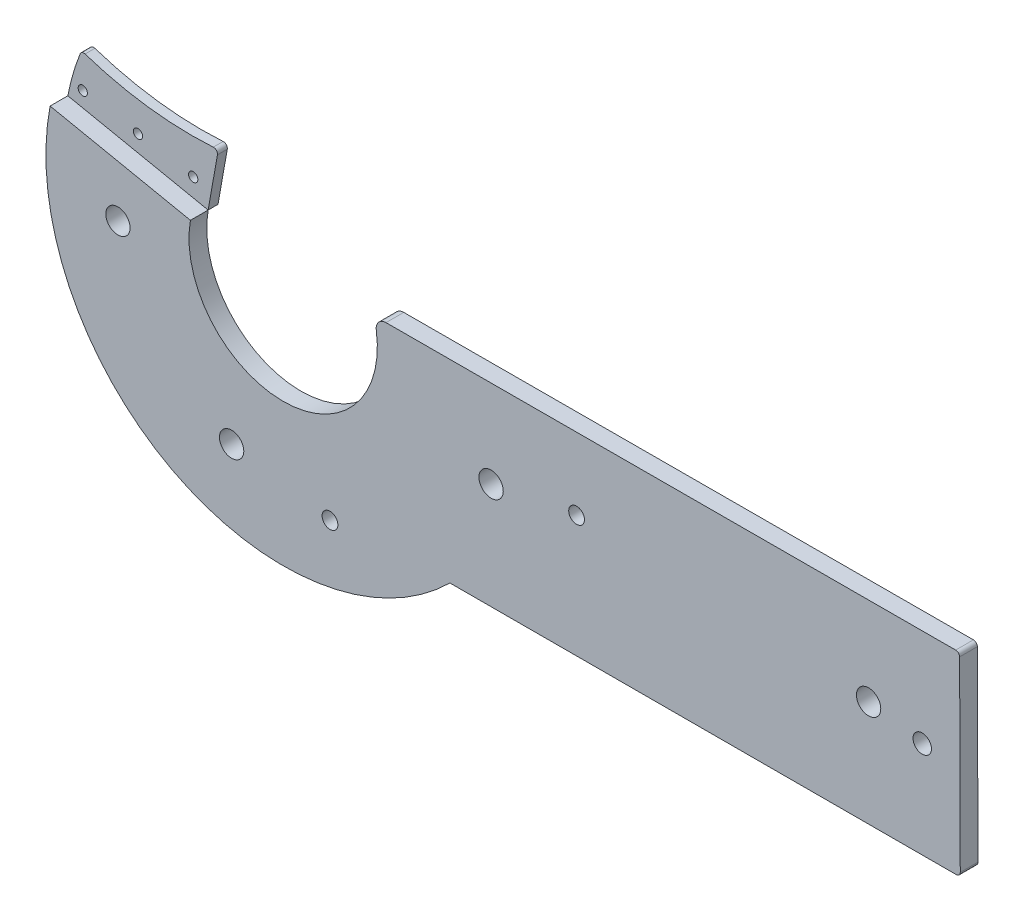
ISO-10303-21;
HEADER;
FILE_DESCRIPTION(('STEP AP214'),'2;1');
FILE_NAME('part.step','',(''),(''),'','','');
FILE_SCHEMA(('AUTOMOTIVE_DESIGN { 1 0 10303 214 1 1 1 1 }'));
ENDSEC;
DATA;
#1=APPLICATION_CONTEXT('core data for automotive mechanical design processes');
#2=APPLICATION_PROTOCOL_DEFINITION('international standard','automotive_design',2000,#1);
#3=PRODUCT_CONTEXT('',#1,'mechanical');
#4=PRODUCT('Part','Part','',(#3));
#5=PRODUCT_RELATED_PRODUCT_CATEGORY('part','',(#4));
#6=PRODUCT_DEFINITION_FORMATION('','',#4);
#7=PRODUCT_DEFINITION_CONTEXT('part definition',#1,'design');
#8=PRODUCT_DEFINITION('design','',#6,#7);
#9=PRODUCT_DEFINITION_SHAPE('','',#8);
#10=(LENGTH_UNIT() NAMED_UNIT(*) SI_UNIT(.MILLI.,.METRE.));
#11=(NAMED_UNIT(*) PLANE_ANGLE_UNIT() SI_UNIT($,.RADIAN.));
#12=(NAMED_UNIT(*) SI_UNIT($,.STERADIAN.) SOLID_ANGLE_UNIT());
#13=UNCERTAINTY_MEASURE_WITH_UNIT(LENGTH_MEASURE(1.E-05),#10,'distance_accuracy_value','');
#14=(GEOMETRIC_REPRESENTATION_CONTEXT(3) GLOBAL_UNCERTAINTY_ASSIGNED_CONTEXT((#13)) GLOBAL_UNIT_ASSIGNED_CONTEXT((#10,
#11,#12)) REPRESENTATION_CONTEXT('',''));
#15=CARTESIAN_POINT('',(0.,0.,0.));
#16=DIRECTION('',(0.,0.,1.));
#17=DIRECTION('',(1.,0.,0.));
#18=AXIS2_PLACEMENT_3D('',#15,#16,#17);
#19=CARTESIAN_POINT('',(85.1478365346288,124.368059743486,-5.));
#20=DIRECTION('',(0.,0.,-1.));
#21=DIRECTION('',(-1.,0.,0.));
#22=AXIS2_PLACEMENT_3D('',#19,#20,#21);
#23=PLANE('',#22);
#24=CARTESIAN_POINT('',(-25.5496424251232,153.010226503566,-5.));
#25=DIRECTION('',(0.,0.,-1.));
#26=DIRECTION('',(-1.,0.,0.));
#27=AXIS2_PLACEMENT_3D('',#24,#25,#26);
#28=CIRCLE('',#27,2.34999999999999);
#29=CARTESIAN_POINT('',(-27.8996424251232,153.010226503566,-5.));
#30=VERTEX_POINT('',#29);
#31=EDGE_CURVE('E167',#30,#30,#28,.T.);
#32=ORIENTED_EDGE('',*,*,#31,.F.);
#33=EDGE_LOOP('',(#32));
#34=FACE_BOUND('',#33,.T.);
#35=CARTESIAN_POINT('',(85.1478365346288,124.368059743486,-5.));
#36=DIRECTION('',(0.,0.,-1.));
#37=DIRECTION('',(-1.,0.,0.));
#38=AXIS2_PLACEMENT_3D('',#35,#36,#37);
#39=CIRCLE('',#38,120.419266545608);
#40=CARTESIAN_POINT('',(-33.1430876887958,146.908179569039,-5.));
#41=VERTEX_POINT('',#40);
#42=CARTESIAN_POINT('',(-26.8975363385449,168.488737130554,-5.));
#43=VERTEX_POINT('',#42);
#44=EDGE_CURVE('E137',#41,#43,#39,.T.);
#45=ORIENTED_EDGE('',*,*,#44,.T.);
#46=CARTESIAN_POINT('',(-25.0366153067641,167.755952773819,-5.));
#47=DIRECTION('',(0.,0.,-1.));
#48=DIRECTION('',(-1.,0.,0.));
#49=AXIS2_PLACEMENT_3D('',#46,#47,#48);
#50=CIRCLE('',#49,2.);
#51=CARTESIAN_POINT('',(-24.4074180608108,169.654402358529,-5.));
#52=VERTEX_POINT('',#51);
#53=EDGE_CURVE('E58',#43,#52,#50,.T.);
#54=ORIENTED_EDGE('',*,*,#53,.T.);
#55=CARTESIAN_POINT('',(29.8079807290533,333.236175768158,-5.));
#56=DIRECTION('',(0.,0.,1.));
#57=DIRECTION('',(-1.,0.,0.));
#58=AXIS2_PLACEMENT_3D('',#55,#56,#57);
#59=CIRCLE('',#58,172.331964701222);
#60=CARTESIAN_POINT('',(40.6968070367358,161.248561332047,-5.));
#61=VERTEX_POINT('',#60);
#62=EDGE_CURVE('E111',#52,#61,#59,.T.);
#63=ORIENTED_EDGE('',*,*,#62,.T.);
#64=CARTESIAN_POINT('',(40.8231773978764,159.252557691813,-5.));
#65=DIRECTION('',(0.,0.,-1.));
#66=DIRECTION('',(-1.,0.,0.));
#67=AXIS2_PLACEMENT_3D('',#64,#65,#66);
#68=CIRCLE('',#67,2.);
#69=CARTESIAN_POINT('',(42.792525815014,158.903749991328,-5.));
#70=VERTEX_POINT('',#69);
#71=EDGE_CURVE('E65',#61,#70,#68,.T.);
#72=ORIENTED_EDGE('',*,*,#71,.T.);
#73=DIRECTION('',(-0.17440385024251,-0.984674208568798,0.));
#74=VECTOR('',#73,1.);
#75=CARTESIAN_POINT('',(43.2396962330615,161.42844871142,-5.));
#76=LINE('',#75,#74);
#77=CARTESIAN_POINT('',(38.0785040558775,132.288651537943,-5.));
#78=VERTEX_POINT('',#77);
#79=EDGE_CURVE('E103',#70,#78,#76,.T.);
#80=ORIENTED_EDGE('',*,*,#79,.T.);
#81=DIRECTION('',(-0.979575697040969,0.201075741368022,0.));
#82=VECTOR('',#81,1.);
#83=CARTESIAN_POINT('',(-33.1430876887958,146.908179569039,-5.));
#84=LINE('',#83,#82);
#85=EDGE_CURVE('E107',#78,#41,#84,.T.);
#86=ORIENTED_EDGE('',*,*,#85,.T.);
#87=EDGE_LOOP('',(#45,#54,#63,#72,#80,#86));
#88=FACE_BOUND('',#87,.T.);
#89=CARTESIAN_POINT('',(2.46770818354081,148.035842501551,-5.));
#90=DIRECTION('',(0.,0.,-1.));
#91=DIRECTION('',(-1.,0.,0.));
#92=AXIS2_PLACEMENT_3D('',#89,#90,#91);
#93=CIRCLE('',#92,2.35);
#94=CARTESIAN_POINT('',(0.117708183540816,148.035842501551,-5.));
#95=VERTEX_POINT('',#94);
#96=EDGE_CURVE('E132',#95,#95,#93,.T.);
#97=ORIENTED_EDGE('',*,*,#96,.F.);
#98=EDGE_LOOP('',(#97));
#99=FACE_BOUND('',#98,.T.);
#100=CARTESIAN_POINT('',(30.4850587922048,143.061458499535,-5.));
#101=DIRECTION('',(0.,0.,-1.));
#102=DIRECTION('',(-1.,0.,0.));
#103=AXIS2_PLACEMENT_3D('',#100,#101,#102);
#104=CIRCLE('',#103,2.35);
#105=CARTESIAN_POINT('',(28.1350587922048,143.061458499535,-5.));
#106=VERTEX_POINT('',#105);
#107=EDGE_CURVE('E173',#106,#106,#104,.T.);
#108=ORIENTED_EDGE('',*,*,#107,.F.);
#109=EDGE_LOOP('',(#108));
#110=FACE_BOUND('',#109,.T.);
#111=ADVANCED_FACE('F50',(#34,#88,#99,#110),#23,.T.);
#112=CARTESIAN_POINT('',(85.1478365346288,124.368059743486,0.));
#113=DIRECTION('',(0.,0.,-1.));
#114=DIRECTION('',(-1.,0.,0.));
#115=AXIS2_PLACEMENT_3D('',#112,#113,#114);
#116=PLANE('',#115);
#117=CARTESIAN_POINT('',(29.8079807290533,333.236175768158,0.));
#118=DIRECTION('',(0.,0.,1.));
#119=DIRECTION('',(-1.,0.,0.));
#120=AXIS2_PLACEMENT_3D('',#117,#118,#119);
#121=CIRCLE('',#120,172.331964701222);
#122=CARTESIAN_POINT('',(-24.4074180608108,169.654402358529,0.));
#123=VERTEX_POINT('',#122);
#124=CARTESIAN_POINT('',(40.6968070367358,161.248561332047,0.));
#125=VERTEX_POINT('',#124);
#126=EDGE_CURVE('E131',#123,#125,#121,.T.);
#127=ORIENTED_EDGE('',*,*,#126,.F.);
#128=CARTESIAN_POINT('',(-25.0366153067641,167.755952773819,0.));
#129=DIRECTION('',(0.,0.,-1.));
#130=DIRECTION('',(-1.,0.,0.));
#131=AXIS2_PLACEMENT_3D('',#128,#129,#130);
#132=CIRCLE('',#131,2.);
#133=CARTESIAN_POINT('',(-26.8975363385449,168.488737130554,0.));
#134=VERTEX_POINT('',#133);
#135=EDGE_CURVE('E145',#123,#134,#132,.F.);
#136=ORIENTED_EDGE('',*,*,#135,.T.);
#137=CARTESIAN_POINT('',(85.1478365346288,124.368059743486,0.));
#138=DIRECTION('',(0.,0.,-1.));
#139=DIRECTION('',(-1.,0.,0.));
#140=AXIS2_PLACEMENT_3D('',#137,#138,#139);
#141=CIRCLE('',#140,120.419266545608);
#142=CARTESIAN_POINT('',(-33.1430876887958,146.908179569039,0.));
#143=VERTEX_POINT('',#142);
#144=EDGE_CURVE('E129',#143,#134,#141,.T.);
#145=ORIENTED_EDGE('',*,*,#144,.F.);
#146=DIRECTION('',(-0.979575697040969,0.201075741368022,0.));
#147=VECTOR('',#146,1.);
#148=CARTESIAN_POINT('',(-33.1430876887958,146.908179569039,0.));
#149=LINE('',#148,#147);
#150=CARTESIAN_POINT('',(38.0785040558775,132.288651537943,0.));
#151=VERTEX_POINT('',#150);
#152=EDGE_CURVE('E136',#151,#143,#149,.T.);
#153=ORIENTED_EDGE('',*,*,#152,.F.);
#154=DIRECTION('',(-0.17440385024251,-0.984674208568798,0.));
#155=VECTOR('',#154,1.);
#156=CARTESIAN_POINT('',(43.2396962330615,161.42844871142,0.));
#157=LINE('',#156,#155);
#158=CARTESIAN_POINT('',(42.792525815014,158.903749991328,0.));
#159=VERTEX_POINT('',#158);
#160=EDGE_CURVE('E117',#159,#151,#157,.T.);
#161=ORIENTED_EDGE('',*,*,#160,.F.);
#162=CARTESIAN_POINT('',(40.8231773978764,159.252557691813,0.));
#163=DIRECTION('',(0.,0.,-1.));
#164=DIRECTION('',(-1.,0.,0.));
#165=AXIS2_PLACEMENT_3D('',#162,#163,#164);
#166=CIRCLE('',#165,2.);
#167=EDGE_CURVE('E143',#159,#125,#166,.F.);
#168=ORIENTED_EDGE('',*,*,#167,.T.);
#169=EDGE_LOOP('',(#127,#136,#145,#153,#161,#168));
#170=FACE_BOUND('',#169,.T.);
#171=CARTESIAN_POINT('',(2.46770818354081,148.035842501551,0.));
#172=DIRECTION('',(0.,0.,-1.));
#173=DIRECTION('',(-1.,0.,0.));
#174=AXIS2_PLACEMENT_3D('',#171,#172,#173);
#175=CIRCLE('',#174,2.35);
#176=CARTESIAN_POINT('',(0.117708183540816,148.035842501551,0.));
#177=VERTEX_POINT('',#176);
#178=EDGE_CURVE('E164',#177,#177,#175,.T.);
#179=ORIENTED_EDGE('',*,*,#178,.T.);
#180=EDGE_LOOP('',(#179));
#181=FACE_BOUND('',#180,.T.);
#182=CARTESIAN_POINT('',(-25.5496424251232,153.010226503566,0.));
#183=DIRECTION('',(0.,0.,-1.));
#184=DIRECTION('',(-1.,0.,0.));
#185=AXIS2_PLACEMENT_3D('',#182,#183,#184);
#186=CIRCLE('',#185,2.34999999999999);
#187=CARTESIAN_POINT('',(-27.8996424251232,153.010226503566,0.));
#188=VERTEX_POINT('',#187);
#189=EDGE_CURVE('E170',#188,#188,#186,.T.);
#190=ORIENTED_EDGE('',*,*,#189,.T.);
#191=EDGE_LOOP('',(#190));
#192=FACE_BOUND('',#191,.T.);
#193=CARTESIAN_POINT('',(30.4850587922048,143.061458499535,0.));
#194=DIRECTION('',(0.,0.,-1.));
#195=DIRECTION('',(-1.,0.,0.));
#196=AXIS2_PLACEMENT_3D('',#193,#194,#195);
#197=CIRCLE('',#196,2.35);
#198=CARTESIAN_POINT('',(28.1350587922048,143.061458499535,0.));
#199=VERTEX_POINT('',#198);
#200=EDGE_CURVE('E176',#199,#199,#197,.T.);
#201=ORIENTED_EDGE('',*,*,#200,.T.);
#202=EDGE_LOOP('',(#201));
#203=FACE_BOUND('',#202,.T.);
#204=ADVANCED_FACE('F159',(#170,#181,#192,#203),#116,.F.);
#205=CARTESIAN_POINT('',(85.1478365346288,124.368059743486,-5.));
#206=DIRECTION('',(0.,0.,1.));
#207=DIRECTION('',(1.,0.,0.));
#208=AXIS2_PLACEMENT_3D('',#205,#206,#207);
#209=CYLINDRICAL_SURFACE('',#208,120.419266545608);
#210=ORIENTED_EDGE('',*,*,#144,.T.);
#211=DIRECTION('',(0.,0.,1.));
#212=VECTOR('',#211,1.);
#213=CARTESIAN_POINT('',(-26.8975363385449,168.488737130554,-5.));
#214=LINE('',#213,#212);
#215=EDGE_CURVE('E73',#134,#43,#214,.F.);
#216=ORIENTED_EDGE('',*,*,#215,.T.);
#217=ORIENTED_EDGE('',*,*,#44,.F.);
#218=DIRECTION('',(0.,0.,1.));
#219=VECTOR('',#218,1.);
#220=CARTESIAN_POINT('',(-33.1430876887958,146.908179569039,-5.));
#221=LINE('',#220,#219);
#222=EDGE_CURVE('E121',#41,#143,#221,.T.);
#223=ORIENTED_EDGE('',*,*,#222,.T.);
#224=EDGE_LOOP('',(#210,#216,#217,#223));
#225=FACE_BOUND('',#224,.T.);
#226=ADVANCED_FACE('F161',(#225),#209,.T.);
#227=CARTESIAN_POINT('',(29.8079807290533,333.236175768158,-5.));
#228=DIRECTION('',(0.,0.,1.));
#229=DIRECTION('',(1.,0.,0.));
#230=AXIS2_PLACEMENT_3D('',#227,#228,#229);
#231=CYLINDRICAL_SURFACE('',#230,172.331964701222);
#232=ORIENTED_EDGE('',*,*,#62,.F.);
#233=DIRECTION('',(0.,0.,1.));
#234=VECTOR('',#233,1.);
#235=CARTESIAN_POINT('',(-24.4074180608108,169.654402358529,-5.));
#236=LINE('',#235,#234);
#237=EDGE_CURVE('E140',#52,#123,#236,.T.);
#238=ORIENTED_EDGE('',*,*,#237,.T.);
#239=ORIENTED_EDGE('',*,*,#126,.T.);
#240=DIRECTION('',(0.,0.,1.));
#241=VECTOR('',#240,1.);
#242=CARTESIAN_POINT('',(40.6968070367358,161.248561332047,-5.));
#243=LINE('',#242,#241);
#244=EDGE_CURVE('E120',#125,#61,#243,.F.);
#245=ORIENTED_EDGE('',*,*,#244,.T.);
#246=EDGE_LOOP('',(#232,#238,#239,#245));
#247=FACE_BOUND('',#246,.T.);
#248=ADVANCED_FACE('F153',(#247),#231,.F.);
#249=CARTESIAN_POINT('',(43.2396962330615,161.42844871142,-5.));
#250=DIRECTION('',(-0.984674208568798,0.17440385024251,0.));
#251=DIRECTION('',(-0.17440385024251,-0.984674208568798,0.));
#252=AXIS2_PLACEMENT_3D('',#249,#250,#251);
#253=PLANE('',#252);
#254=ORIENTED_EDGE('',*,*,#79,.F.);
#255=DIRECTION('',(0.,0.,1.));
#256=VECTOR('',#255,1.);
#257=CARTESIAN_POINT('',(42.792525815014,158.903749991328,-5.));
#258=LINE('',#257,#256);
#259=EDGE_CURVE('E12',#70,#159,#258,.T.);
#260=ORIENTED_EDGE('',*,*,#259,.T.);
#261=ORIENTED_EDGE('',*,*,#160,.T.);
#262=DIRECTION('',(0.,0.,1.));
#263=VECTOR('',#262,1.);
#264=CARTESIAN_POINT('',(38.0785040558775,132.288651537943,-5.));
#265=LINE('',#264,#263);
#266=EDGE_CURVE('E114',#78,#151,#265,.T.);
#267=ORIENTED_EDGE('',*,*,#266,.F.);
#268=EDGE_LOOP('',(#254,#260,#261,#267));
#269=FACE_BOUND('',#268,.T.);
#270=ADVANCED_FACE('F115',(#269),#253,.F.);
#271=CARTESIAN_POINT('',(-33.1430876887958,146.908179569039,-5.));
#272=DIRECTION('',(0.201075741368022,0.979575697040969,0.));
#273=DIRECTION('',(-0.979575697040969,0.201075741368022,0.));
#274=AXIS2_PLACEMENT_3D('',#271,#272,#273);
#275=PLANE('',#274);
#276=ORIENTED_EDGE('',*,*,#152,.T.);
#277=ORIENTED_EDGE('',*,*,#222,.F.);
#278=ORIENTED_EDGE('',*,*,#85,.F.);
#279=ORIENTED_EDGE('',*,*,#266,.T.);
#280=EDGE_LOOP('',(#276,#277,#278,#279));
#281=FACE_BOUND('',#280,.T.);
#282=ADVANCED_FACE('F123',(#281),#275,.F.);
#283=CARTESIAN_POINT('',(2.46770818354081,148.035842501551,-5.));
#284=DIRECTION('',(0.,0.,1.));
#285=DIRECTION('',(1.,0.,0.));
#286=AXIS2_PLACEMENT_3D('',#283,#284,#285);
#287=CYLINDRICAL_SURFACE('',#286,2.35);
#288=ORIENTED_EDGE('',*,*,#96,.T.);
#289=EDGE_LOOP('',(#288));
#290=FACE_BOUND('',#289,.T.);
#291=ORIENTED_EDGE('',*,*,#178,.F.);
#292=EDGE_LOOP('',(#291));
#293=FACE_BOUND('',#292,.T.);
#294=ADVANCED_FACE('F194',(#290,#293),#287,.F.);
#295=CARTESIAN_POINT('',(-25.5496424251232,153.010226503566,-5.));
#296=DIRECTION('',(0.,0.,1.));
#297=DIRECTION('',(1.,0.,0.));
#298=AXIS2_PLACEMENT_3D('',#295,#296,#297);
#299=CYLINDRICAL_SURFACE('',#298,2.34999999999999);
#300=ORIENTED_EDGE('',*,*,#31,.T.);
#301=EDGE_LOOP('',(#300));
#302=FACE_BOUND('',#301,.T.);
#303=ORIENTED_EDGE('',*,*,#189,.F.);
#304=EDGE_LOOP('',(#303));
#305=FACE_BOUND('',#304,.T.);
#306=ADVANCED_FACE('F210',(#302,#305),#299,.F.);
#307=CARTESIAN_POINT('',(30.4850587922048,143.061458499535,-5.));
#308=DIRECTION('',(0.,0.,1.));
#309=DIRECTION('',(1.,0.,0.));
#310=AXIS2_PLACEMENT_3D('',#307,#308,#309);
#311=CYLINDRICAL_SURFACE('',#310,2.35);
#312=ORIENTED_EDGE('',*,*,#107,.T.);
#313=EDGE_LOOP('',(#312));
#314=FACE_BOUND('',#313,.T.);
#315=ORIENTED_EDGE('',*,*,#200,.F.);
#316=EDGE_LOOP('',(#315));
#317=FACE_BOUND('',#316,.T.);
#318=ADVANCED_FACE('F182',(#314,#317),#311,.F.);
#319=CARTESIAN_POINT('',(-25.0366153067641,167.755952773819,-5.));
#320=DIRECTION('',(0.,0.,-1.));
#321=DIRECTION('',(-1.,0.,0.));
#322=AXIS2_PLACEMENT_3D('',#319,#320,#321);
#323=CYLINDRICAL_SURFACE('',#322,2.);
#324=ORIENTED_EDGE('',*,*,#53,.F.);
#325=ORIENTED_EDGE('',*,*,#215,.F.);
#326=ORIENTED_EDGE('',*,*,#135,.F.);
#327=ORIENTED_EDGE('',*,*,#237,.F.);
#328=EDGE_LOOP('',(#324,#325,#326,#327));
#329=FACE_BOUND('',#328,.T.);
#330=ADVANCED_FACE('F156',(#329),#323,.T.);
#331=CARTESIAN_POINT('',(40.8231773978764,159.252557691813,-5.));
#332=DIRECTION('',(0.,0.,1.));
#333=DIRECTION('',(1.,0.,0.));
#334=AXIS2_PLACEMENT_3D('',#331,#332,#333);
#335=CYLINDRICAL_SURFACE('',#334,2.);
#336=ORIENTED_EDGE('',*,*,#71,.F.);
#337=ORIENTED_EDGE('',*,*,#244,.F.);
#338=ORIENTED_EDGE('',*,*,#167,.F.);
#339=ORIENTED_EDGE('',*,*,#259,.F.);
#340=EDGE_LOOP('',(#336,#337,#338,#339));
#341=FACE_BOUND('',#340,.T.);
#342=ADVANCED_FACE('F52',(#341),#335,.T.);
#343=CLOSED_SHELL('',(#111,#204,#226,#248,#270,#282,#294,#306,#318,#330,#342));
#344=MANIFOLD_SOLID_BREP('B2',#343);
#345=CARTESIAN_POINT('',(85.1478365346288,124.368059743486,9.));
#346=DIRECTION('',(0.,0.,1.));
#347=DIRECTION('',(1.,0.,0.));
#348=AXIS2_PLACEMENT_3D('',#345,#346,#347);
#349=PLANE('',#348);
#350=CARTESIAN_POINT('',(108.920722633758,35.8266026056695,9.));
#351=DIRECTION('',(0.,0.,1.));
#352=DIRECTION('',(1.,0.,0.));
#353=AXIS2_PLACEMENT_3D('',#350,#351,#352);
#354=CIRCLE('',#353,4.00000000000001);
#355=CARTESIAN_POINT('',(112.920722633758,35.8266026056695,9.));
#356=VERTEX_POINT('',#355);
#357=EDGE_CURVE('E498',#356,#356,#354,.T.);
#358=ORIENTED_EDGE('',*,*,#357,.F.);
#359=EDGE_LOOP('',(#358));
#360=FACE_BOUND('',#359,.T.);
#361=CARTESIAN_POINT('',(234.08314410496,100.646929332703,9.));
#362=DIRECTION('',(0.,0.,1.));
#363=DIRECTION('',(1.,0.,0.));
#364=AXIS2_PLACEMENT_3D('',#361,#362,#363);
#365=CIRCLE('',#364,3.99999999999999);
#366=CARTESIAN_POINT('',(238.08314410496,100.646929332703,9.));
#367=VERTEX_POINT('',#366);
#368=EDGE_CURVE('E486',#367,#367,#365,.T.);
#369=ORIENTED_EDGE('',*,*,#368,.F.);
#370=EDGE_LOOP('',(#369));
#371=FACE_BOUND('',#370,.T.);
#372=CARTESIAN_POINT('',(382.297443758969,92.7239824857239,9.));
#373=DIRECTION('',(0.,0.,1.));
#374=DIRECTION('',(1.,0.,0.));
#375=AXIS2_PLACEMENT_3D('',#372,#373,#374);
#376=CIRCLE('',#375,6.17499999999997);
#377=CARTESIAN_POINT('',(388.472443758969,92.7239824857239,9.));
#378=VERTEX_POINT('',#377);
#379=EDGE_CURVE('E473',#378,#378,#376,.T.);
#380=ORIENTED_EDGE('',*,*,#379,.F.);
#381=EDGE_LOOP('',(#380));
#382=FACE_BOUND('',#381,.T.);
#383=DIRECTION('',(-0.00344386395279394,0.999994069882954,0.));
#384=VECTOR('',#383,1.);
#385=CARTESIAN_POINT('',(428.491868013747,137.593385628409,9.));
#386=LINE('',#385,#384);
#387=CARTESIAN_POINT('',(428.82437637219,41.0430017610581,9.));
#388=VERTEX_POINT('',#387);
#389=CARTESIAN_POINT('',(428.498747132906,135.59589720849,9.));
#390=VERTEX_POINT('',#389);
#391=EDGE_CURVE('E390',#388,#390,#386,.T.);
#392=ORIENTED_EDGE('',*,*,#391,.T.);
#393=CARTESIAN_POINT('',(426.49875899314,135.589009480584,9.));
#394=DIRECTION('',(0.,0.,1.));
#395=DIRECTION('',(1.,0.,0.));
#396=AXIS2_PLACEMENT_3D('',#393,#394,#395);
#397=CIRCLE('',#396,2.);
#398=CARTESIAN_POINT('',(426.494372552627,137.589004670363,9.));
#399=VERTEX_POINT('',#398);
#400=EDGE_CURVE('E320',#390,#399,#397,.T.);
#401=ORIENTED_EDGE('',*,*,#400,.T.);
#402=DIRECTION('',(-0.99999759488956,-0.00219322025694324,0.));
#403=VECTOR('',#402,1.);
#404=CARTESIAN_POINT('',(131.185001267815,136.941324617454,9.));
#405=LINE('',#404,#403);
#406=CARTESIAN_POINT('',(137.352673442184,136.954851713539,9.));
#407=VERTEX_POINT('',#406);
#408=EDGE_CURVE('E437',#399,#407,#405,.T.);
#409=ORIENTED_EDGE('',*,*,#408,.T.);
#410=CARTESIAN_POINT('',(137.363639543468,131.954863739092,9.));
#411=DIRECTION('',(0.,0.,1.));
#412=DIRECTION('',(1.,0.,0.));
#413=AXIS2_PLACEMENT_3D('',#410,#411,#412);
#414=CIRCLE('',#413,5.);
#415=CARTESIAN_POINT('',(132.420278792512,131.204407553892,9.));
#416=VERTEX_POINT('',#415);
#417=EDGE_CURVE('E421',#407,#416,#414,.T.);
#418=ORIENTED_EDGE('',*,*,#417,.T.);
#419=CARTESIAN_POINT('',(85.1607061918032,124.029887959864,9.));
#420=DIRECTION('',(0.,0.,-1.));
#421=DIRECTION('',(1.,0.,0.));
#422=AXIS2_PLACEMENT_3D('',#419,#420,#421);
#423=CIRCLE('',#422,47.8010557812982);
#424=CARTESIAN_POINT('',(38.0785040558775,132.288651537943,9.));
#425=VERTEX_POINT('',#424);
#426=EDGE_CURVE('E445',#416,#425,#423,.T.);
#427=ORIENTED_EDGE('',*,*,#426,.T.);
#428=DIRECTION('',(-0.979575697040969,0.201075741368022,0.));
#429=VECTOR('',#428,1.);
#430=CARTESIAN_POINT('',(38.0785040558774,132.288651537943,9.));
#431=LINE('',#430,#429);
#432=CARTESIAN_POINT('',(-33.1430876887958,146.908179569039,9.));
#433=VERTEX_POINT('',#432);
#434=EDGE_CURVE('E396',#425,#433,#431,.T.);
#435=ORIENTED_EDGE('',*,*,#434,.T.);
#436=CARTESIAN_POINT('',(85.1478365346288,124.368059743486,9.));
#437=DIRECTION('',(0.,0.,1.));
#438=DIRECTION('',(1.,0.,0.));
#439=AXIS2_PLACEMENT_3D('',#436,#437,#438);
#440=CIRCLE('',#439,120.419266545608);
#441=CARTESIAN_POINT('',(169.784133841993,38.7088691479545,9.));
#442=VERTEX_POINT('',#441);
#443=EDGE_CURVE('E391',#433,#442,#440,.T.);
#444=ORIENTED_EDGE('',*,*,#443,.T.);
#445=DIRECTION('',(0.999999189582848,0.0012731196517639,0.));
#446=VECTOR('',#445,1.);
#447=CARTESIAN_POINT('',(169.784133841993,38.7088691479545,9.));
#448=LINE('',#447,#446);
#449=CARTESIAN_POINT('',(426.826934471727,39.0361156539868,9.));
#450=VERTEX_POINT('',#449);
#451=EDGE_CURVE('E382',#442,#450,#448,.T.);
#452=ORIENTED_EDGE('',*,*,#451,.T.);
#453=CARTESIAN_POINT('',(426.824388232424,41.0361140331525,9.));
#454=DIRECTION('',(0.,0.,1.));
#455=DIRECTION('',(1.,0.,0.));
#456=AXIS2_PLACEMENT_3D('',#453,#454,#455);
#457=CIRCLE('',#456,2.);
#458=EDGE_CURVE('E434',#450,#388,#457,.T.);
#459=ORIENTED_EDGE('',*,*,#458,.T.);
#460=EDGE_LOOP('',(#392,#401,#409,#418,#427,#435,#444,#452,#459));
#461=FACE_BOUND('',#460,.T.);
#462=CARTESIAN_POINT('',(190.69502548042,92.6156914569061,9.));
#463=DIRECTION('',(0.,0.,1.));
#464=DIRECTION('',(1.,0.,0.));
#465=AXIS2_PLACEMENT_3D('',#462,#463,#464);
#466=CIRCLE('',#465,6.17499999999999);
#467=CARTESIAN_POINT('',(196.87002548042,92.6156914569061,9.));
#468=VERTEX_POINT('',#467);
#469=EDGE_CURVE('E466',#468,#468,#466,.T.);
#470=ORIENTED_EDGE('',*,*,#469,.F.);
#471=EDGE_LOOP('',(#470));
#472=FACE_BOUND('',#471,.T.);
#473=CARTESIAN_POINT('',(409.521133250289,88.0049079975689,9.));
#474=DIRECTION('',(0.,0.,1.));
#475=DIRECTION('',(1.,0.,0.));
#476=AXIS2_PLACEMENT_3D('',#473,#474,#475);
#477=CIRCLE('',#476,4.67499999999999);
#478=CARTESIAN_POINT('',(414.196133250289,88.0049079975689,9.));
#479=VERTEX_POINT('',#478);
#480=EDGE_CURVE('E480',#479,#479,#477,.T.);
#481=ORIENTED_EDGE('',*,*,#480,.F.);
#482=EDGE_LOOP('',(#481));
#483=FACE_BOUND('',#482,.T.);
#484=CARTESIAN_POINT('',(58.9921068538031,44.3279909760892,9.));
#485=DIRECTION('',(0.,0.,1.));
#486=DIRECTION('',(1.,0.,0.));
#487=AXIS2_PLACEMENT_3D('',#484,#485,#486);
#488=CIRCLE('',#487,6.17500000000001);
#489=CARTESIAN_POINT('',(65.1671068538031,44.3279909760892,9.));
#490=VERTEX_POINT('',#489);
#491=EDGE_CURVE('E492',#490,#490,#488,.T.);
#492=ORIENTED_EDGE('',*,*,#491,.F.);
#493=EDGE_LOOP('',(#492));
#494=FACE_BOUND('',#493,.T.);
#495=CARTESIAN_POINT('',(1.28804924227482,113.626800727221,9.));
#496=DIRECTION('',(0.,0.,1.));
#497=DIRECTION('',(1.,0.,0.));
#498=AXIS2_PLACEMENT_3D('',#495,#496,#497);
#499=CIRCLE('',#498,6.175);
#500=CARTESIAN_POINT('',(7.46304924227482,113.626800727221,9.));
#501=VERTEX_POINT('',#500);
#502=EDGE_CURVE('E504',#501,#501,#499,.T.);
#503=ORIENTED_EDGE('',*,*,#502,.F.);
#504=EDGE_LOOP('',(#503));
#505=FACE_BOUND('',#504,.T.);
#506=ADVANCED_FACE('F312',(#360,#371,#382,#461,#472,#483,#494,#505),#349,.T.);
#507=CARTESIAN_POINT('',(85.1478365346288,124.368059743486,0.));
#508=DIRECTION('',(0.,0.,1.));
#509=DIRECTION('',(1.,0.,0.));
#510=AXIS2_PLACEMENT_3D('',#507,#508,#509);
#511=PLANE('',#510);
#512=DIRECTION('',(-0.99999759488956,-0.00219322025694324,0.));
#513=VECTOR('',#512,1.);
#514=CARTESIAN_POINT('',(131.185001267815,136.941324617454,0.));
#515=LINE('',#514,#513);
#516=CARTESIAN_POINT('',(426.494372552627,137.589004670363,0.));
#517=VERTEX_POINT('',#516);
#518=CARTESIAN_POINT('',(137.352673442184,136.954851713539,0.));
#519=VERTEX_POINT('',#518);
#520=EDGE_CURVE('E453',#517,#519,#515,.T.);
#521=ORIENTED_EDGE('',*,*,#520,.F.);
#522=CARTESIAN_POINT('',(426.49875899314,135.589009480584,0.));
#523=DIRECTION('',(0.,0.,1.));
#524=DIRECTION('',(1.,0.,0.));
#525=AXIS2_PLACEMENT_3D('',#522,#523,#524);
#526=CIRCLE('',#525,2.);
#527=CARTESIAN_POINT('',(428.498747132906,135.59589720849,0.));
#528=VERTEX_POINT('',#527);
#529=EDGE_CURVE('E428',#517,#528,#526,.F.);
#530=ORIENTED_EDGE('',*,*,#529,.T.);
#531=DIRECTION('',(-0.00344386395279394,0.999994069882954,0.));
#532=VECTOR('',#531,1.);
#533=CARTESIAN_POINT('',(428.491868013747,137.593385628409,0.));
#534=LINE('',#533,#532);
#535=CARTESIAN_POINT('',(428.82437637219,41.0430017610581,0.));
#536=VERTEX_POINT('',#535);
#537=EDGE_CURVE('E452',#536,#528,#534,.T.);
#538=ORIENTED_EDGE('',*,*,#537,.F.);
#539=CARTESIAN_POINT('',(426.824388232424,41.0361140331525,0.));
#540=DIRECTION('',(0.,0.,1.));
#541=DIRECTION('',(1.,0.,0.));
#542=AXIS2_PLACEMENT_3D('',#539,#540,#541);
#543=CIRCLE('',#542,2.);
#544=CARTESIAN_POINT('',(426.826934471727,39.0361156539868,0.));
#545=VERTEX_POINT('',#544);
#546=EDGE_CURVE('E426',#536,#545,#543,.F.);
#547=ORIENTED_EDGE('',*,*,#546,.T.);
#548=DIRECTION('',(0.999999189582848,0.0012731196517639,0.));
#549=VECTOR('',#548,1.);
#550=CARTESIAN_POINT('',(169.784133841993,38.7088691479545,0.));
#551=LINE('',#550,#549);
#552=CARTESIAN_POINT('',(169.784133841993,38.7088691479545,0.));
#553=VERTEX_POINT('',#552);
#554=EDGE_CURVE('E456',#553,#545,#551,.T.);
#555=ORIENTED_EDGE('',*,*,#554,.F.);
#556=CARTESIAN_POINT('',(85.1478365346288,124.368059743486,0.));
#557=DIRECTION('',(0.,0.,1.));
#558=DIRECTION('',(1.,0.,0.));
#559=AXIS2_PLACEMENT_3D('',#556,#557,#558);
#560=CIRCLE('',#559,120.419266545608);
#561=CARTESIAN_POINT('',(-33.1430876887958,146.908179569039,0.));
#562=VERTEX_POINT('',#561);
#563=EDGE_CURVE('E404',#562,#553,#560,.T.);
#564=ORIENTED_EDGE('',*,*,#563,.F.);
#565=DIRECTION('',(-0.979575697040969,0.201075741368022,0.));
#566=VECTOR('',#565,1.);
#567=CARTESIAN_POINT('',(38.0785040558774,132.288651537943,0.));
#568=LINE('',#567,#566);
#569=CARTESIAN_POINT('',(38.0785040558775,132.288651537943,0.));
#570=VERTEX_POINT('',#569);
#571=EDGE_CURVE('E400',#570,#562,#568,.T.);
#572=ORIENTED_EDGE('',*,*,#571,.F.);
#573=CARTESIAN_POINT('',(85.1607061918032,124.029887959864,0.));
#574=DIRECTION('',(0.,0.,-1.));
#575=DIRECTION('',(1.,0.,0.));
#576=AXIS2_PLACEMENT_3D('',#573,#574,#575);
#577=CIRCLE('',#576,47.8010557812982);
#578=CARTESIAN_POINT('',(132.420278792512,131.204407553892,0.));
#579=VERTEX_POINT('',#578);
#580=EDGE_CURVE('E458',#579,#570,#577,.T.);
#581=ORIENTED_EDGE('',*,*,#580,.F.);
#582=CARTESIAN_POINT('',(137.363639543468,131.954863739092,0.));
#583=DIRECTION('',(0.,0.,1.));
#584=DIRECTION('',(1.,0.,0.));
#585=AXIS2_PLACEMENT_3D('',#582,#583,#584);
#586=CIRCLE('',#585,5.);
#587=EDGE_CURVE('E409',#579,#519,#586,.F.);
#588=ORIENTED_EDGE('',*,*,#587,.T.);
#589=EDGE_LOOP('',(#521,#530,#538,#547,#555,#564,#572,#581,#588));
#590=FACE_BOUND('',#589,.T.);
#591=CARTESIAN_POINT('',(190.69502548042,92.6156914569061,0.));
#592=DIRECTION('',(0.,0.,1.));
#593=DIRECTION('',(1.,0.,0.));
#594=AXIS2_PLACEMENT_3D('',#591,#592,#593);
#595=CIRCLE('',#594,6.17499999999999);
#596=CARTESIAN_POINT('',(196.87002548042,92.6156914569061,0.));
#597=VERTEX_POINT('',#596);
#598=EDGE_CURVE('E468',#597,#597,#595,.T.);
#599=ORIENTED_EDGE('',*,*,#598,.T.);
#600=EDGE_LOOP('',(#599));
#601=FACE_BOUND('',#600,.T.);
#602=CARTESIAN_POINT('',(382.297443758969,92.7239824857239,0.));
#603=DIRECTION('',(0.,0.,1.));
#604=DIRECTION('',(1.,0.,0.));
#605=AXIS2_PLACEMENT_3D('',#602,#603,#604);
#606=CIRCLE('',#605,6.17499999999997);
#607=CARTESIAN_POINT('',(388.472443758969,92.7239824857239,0.));
#608=VERTEX_POINT('',#607);
#609=EDGE_CURVE('E476',#608,#608,#606,.T.);
#610=ORIENTED_EDGE('',*,*,#609,.T.);
#611=EDGE_LOOP('',(#610));
#612=FACE_BOUND('',#611,.T.);
#613=CARTESIAN_POINT('',(409.521133250289,88.0049079975689,0.));
#614=DIRECTION('',(0.,0.,1.));
#615=DIRECTION('',(1.,0.,0.));
#616=AXIS2_PLACEMENT_3D('',#613,#614,#615);
#617=CIRCLE('',#616,4.67499999999999);
#618=CARTESIAN_POINT('',(414.196133250289,88.0049079975689,0.));
#619=VERTEX_POINT('',#618);
#620=EDGE_CURVE('E483',#619,#619,#617,.T.);
#621=ORIENTED_EDGE('',*,*,#620,.T.);
#622=EDGE_LOOP('',(#621));
#623=FACE_BOUND('',#622,.T.);
#624=CARTESIAN_POINT('',(234.08314410496,100.646929332703,0.));
#625=DIRECTION('',(0.,0.,1.));
#626=DIRECTION('',(1.,0.,0.));
#627=AXIS2_PLACEMENT_3D('',#624,#625,#626);
#628=CIRCLE('',#627,3.99999999999999);
#629=CARTESIAN_POINT('',(238.08314410496,100.646929332703,0.));
#630=VERTEX_POINT('',#629);
#631=EDGE_CURVE('E489',#630,#630,#628,.T.);
#632=ORIENTED_EDGE('',*,*,#631,.T.);
#633=EDGE_LOOP('',(#632));
#634=FACE_BOUND('',#633,.T.);
#635=CARTESIAN_POINT('',(58.9921068538031,44.3279909760892,0.));
#636=DIRECTION('',(0.,0.,1.));
#637=DIRECTION('',(1.,0.,0.));
#638=AXIS2_PLACEMENT_3D('',#635,#636,#637);
#639=CIRCLE('',#638,6.17500000000001);
#640=CARTESIAN_POINT('',(65.1671068538031,44.3279909760892,0.));
#641=VERTEX_POINT('',#640);
#642=EDGE_CURVE('E495',#641,#641,#639,.T.);
#643=ORIENTED_EDGE('',*,*,#642,.T.);
#644=EDGE_LOOP('',(#643));
#645=FACE_BOUND('',#644,.T.);
#646=CARTESIAN_POINT('',(108.920722633758,35.8266026056695,0.));
#647=DIRECTION('',(0.,0.,1.));
#648=DIRECTION('',(1.,0.,0.));
#649=AXIS2_PLACEMENT_3D('',#646,#647,#648);
#650=CIRCLE('',#649,4.00000000000001);
#651=CARTESIAN_POINT('',(112.920722633758,35.8266026056695,0.));
#652=VERTEX_POINT('',#651);
#653=EDGE_CURVE('E501',#652,#652,#650,.T.);
#654=ORIENTED_EDGE('',*,*,#653,.T.);
#655=EDGE_LOOP('',(#654));
#656=FACE_BOUND('',#655,.T.);
#657=CARTESIAN_POINT('',(1.28804924227482,113.626800727221,0.));
#658=DIRECTION('',(0.,0.,1.));
#659=DIRECTION('',(1.,0.,0.));
#660=AXIS2_PLACEMENT_3D('',#657,#658,#659);
#661=CIRCLE('',#660,6.175);
#662=CARTESIAN_POINT('',(7.46304924227482,113.626800727221,0.));
#663=VERTEX_POINT('',#662);
#664=EDGE_CURVE('E507',#663,#663,#661,.T.);
#665=ORIENTED_EDGE('',*,*,#664,.T.);
#666=EDGE_LOOP('',(#665));
#667=FACE_BOUND('',#666,.T.);
#668=ADVANCED_FACE('F450',(#590,#601,#612,#623,#634,#645,#656,#667),#511,.F.);
#669=CARTESIAN_POINT('',(85.1478365346288,124.368059743486,9.));
#670=DIRECTION('',(0.,0.,-1.));
#671=DIRECTION('',(-1.,0.,0.));
#672=AXIS2_PLACEMENT_3D('',#669,#670,#671);
#673=CYLINDRICAL_SURFACE('',#672,120.419266545608);
#674=ORIENTED_EDGE('',*,*,#563,.T.);
#675=DIRECTION('',(0.,0.,-1.));
#676=VECTOR('',#675,1.);
#677=CARTESIAN_POINT('',(169.784133841993,38.7088691479545,9.));
#678=LINE('',#677,#676);
#679=EDGE_CURVE('E386',#442,#553,#678,.T.);
#680=ORIENTED_EDGE('',*,*,#679,.F.);
#681=ORIENTED_EDGE('',*,*,#443,.F.);
#682=DIRECTION('',(0.,0.,-1.));
#683=VECTOR('',#682,1.);
#684=CARTESIAN_POINT('',(-33.1430876887958,146.908179569039,9.));
#685=LINE('',#684,#683);
#686=EDGE_CURVE('E412',#433,#562,#685,.T.);
#687=ORIENTED_EDGE('',*,*,#686,.T.);
#688=EDGE_LOOP('',(#674,#680,#681,#687));
#689=FACE_BOUND('',#688,.T.);
#690=ADVANCED_FACE('F402',(#689),#673,.T.);
#691=CARTESIAN_POINT('',(169.784133841993,38.7088691479545,9.));
#692=DIRECTION('',(-0.0012731196517639,0.999999189582848,0.));
#693=DIRECTION('',(-0.999999189582848,-0.0012731196517639,0.));
#694=AXIS2_PLACEMENT_3D('',#691,#692,#693);
#695=PLANE('',#694);
#696=ORIENTED_EDGE('',*,*,#554,.T.);
#697=DIRECTION('',(0.,0.,-1.));
#698=VECTOR('',#697,1.);
#699=CARTESIAN_POINT('',(426.826934471727,39.0361156539868,9.));
#700=LINE('',#699,#698);
#701=EDGE_CURVE('E48',#545,#450,#700,.F.);
#702=ORIENTED_EDGE('',*,*,#701,.T.);
#703=ORIENTED_EDGE('',*,*,#451,.F.);
#704=ORIENTED_EDGE('',*,*,#679,.T.);
#705=EDGE_LOOP('',(#696,#702,#703,#704));
#706=FACE_BOUND('',#705,.T.);
#707=ADVANCED_FACE('F384',(#706),#695,.F.);
#708=CARTESIAN_POINT('',(428.491868013747,137.593385628409,9.));
#709=DIRECTION('',(-0.999994069882954,-0.00344386395279394,0.));
#710=DIRECTION('',(0.00344386395279394,-0.999994069882954,0.));
#711=AXIS2_PLACEMENT_3D('',#708,#709,#710);
#712=PLANE('',#711);
#713=ORIENTED_EDGE('',*,*,#537,.T.);
#714=DIRECTION('',(0.,0.,-1.));
#715=VECTOR('',#714,1.);
#716=CARTESIAN_POINT('',(428.498747132906,135.59589720849,9.));
#717=LINE('',#716,#715);
#718=EDGE_CURVE('E333',#528,#390,#717,.F.);
#719=ORIENTED_EDGE('',*,*,#718,.T.);
#720=ORIENTED_EDGE('',*,*,#391,.F.);
#721=DIRECTION('',(0.,0.,-1.));
#722=VECTOR('',#721,1.);
#723=CARTESIAN_POINT('',(428.82437637219,41.0430017610581,9.));
#724=LINE('',#723,#722);
#725=EDGE_CURVE('E430',#388,#536,#724,.T.);
#726=ORIENTED_EDGE('',*,*,#725,.T.);
#727=EDGE_LOOP('',(#713,#719,#720,#726));
#728=FACE_BOUND('',#727,.T.);
#729=ADVANCED_FACE('F454',(#728),#712,.F.);
#730=CARTESIAN_POINT('',(131.185001267815,136.941324617454,9.));
#731=DIRECTION('',(0.00219322025694324,-0.99999759488956,0.));
#732=DIRECTION('',(0.99999759488956,0.00219322025694324,0.));
#733=AXIS2_PLACEMENT_3D('',#730,#731,#732);
#734=PLANE('',#733);
#735=ORIENTED_EDGE('',*,*,#408,.F.);
#736=DIRECTION('',(0.,0.,-1.));
#737=VECTOR('',#736,1.);
#738=CARTESIAN_POINT('',(426.494372552627,137.589004670363,9.));
#739=LINE('',#738,#737);
#740=EDGE_CURVE('E423',#399,#517,#739,.T.);
#741=ORIENTED_EDGE('',*,*,#740,.T.);
#742=ORIENTED_EDGE('',*,*,#520,.T.);
#743=DIRECTION('',(0.,0.,-1.));
#744=VECTOR('',#743,1.);
#745=CARTESIAN_POINT('',(137.352673442184,136.954851713539,9.));
#746=LINE('',#745,#744);
#747=EDGE_CURVE('E418',#519,#407,#746,.F.);
#748=ORIENTED_EDGE('',*,*,#747,.T.);
#749=EDGE_LOOP('',(#735,#741,#742,#748));
#750=FACE_BOUND('',#749,.T.);
#751=ADVANCED_FACE('F441',(#750),#734,.F.);
#752=CARTESIAN_POINT('',(85.1607061918032,124.029887959864,9.));
#753=DIRECTION('',(0.,0.,-1.));
#754=DIRECTION('',(-1.,0.,0.));
#755=AXIS2_PLACEMENT_3D('',#752,#753,#754);
#756=CYLINDRICAL_SURFACE('',#755,47.8010557812982);
#757=ORIENTED_EDGE('',*,*,#426,.F.);
#758=DIRECTION('',(0.,0.,-1.));
#759=VECTOR('',#758,1.);
#760=CARTESIAN_POINT('',(132.420278792512,131.204407553892,9.));
#761=LINE('',#760,#759);
#762=EDGE_CURVE('E405',#416,#579,#761,.T.);
#763=ORIENTED_EDGE('',*,*,#762,.T.);
#764=ORIENTED_EDGE('',*,*,#580,.T.);
#765=DIRECTION('',(0.,0.,-1.));
#766=VECTOR('',#765,1.);
#767=CARTESIAN_POINT('',(38.0785040558775,132.288651537943,9.));
#768=LINE('',#767,#766);
#769=EDGE_CURVE('E406',#425,#570,#768,.T.);
#770=ORIENTED_EDGE('',*,*,#769,.F.);
#771=EDGE_LOOP('',(#757,#763,#764,#770));
#772=FACE_BOUND('',#771,.T.);
#773=ADVANCED_FACE('F532',(#772),#756,.F.);
#774=CARTESIAN_POINT('',(38.0785040558774,132.288651537943,9.));
#775=DIRECTION('',(-0.201075741368022,-0.979575697040969,0.));
#776=DIRECTION('',(0.979575697040969,-0.201075741368022,0.));
#777=AXIS2_PLACEMENT_3D('',#774,#775,#776);
#778=PLANE('',#777);
#779=ORIENTED_EDGE('',*,*,#571,.T.);
#780=ORIENTED_EDGE('',*,*,#686,.F.);
#781=ORIENTED_EDGE('',*,*,#434,.F.);
#782=ORIENTED_EDGE('',*,*,#769,.T.);
#783=EDGE_LOOP('',(#779,#780,#781,#782));
#784=FACE_BOUND('',#783,.T.);
#785=ADVANCED_FACE('F529',(#784),#778,.F.);
#786=CARTESIAN_POINT('',(190.69502548042,92.6156914569061,9.));
#787=DIRECTION('',(0.,0.,-1.));
#788=DIRECTION('',(-1.,0.,0.));
#789=AXIS2_PLACEMENT_3D('',#786,#787,#788);
#790=CYLINDRICAL_SURFACE('',#789,6.17499999999999);
#791=ORIENTED_EDGE('',*,*,#469,.T.);
#792=EDGE_LOOP('',(#791));
#793=FACE_BOUND('',#792,.T.);
#794=ORIENTED_EDGE('',*,*,#598,.F.);
#795=EDGE_LOOP('',(#794));
#796=FACE_BOUND('',#795,.T.);
#797=ADVANCED_FACE('F526',(#793,#796),#790,.F.);
#798=CARTESIAN_POINT('',(382.297443758969,92.7239824857239,9.));
#799=DIRECTION('',(0.,0.,-1.));
#800=DIRECTION('',(-1.,0.,0.));
#801=AXIS2_PLACEMENT_3D('',#798,#799,#800);
#802=CYLINDRICAL_SURFACE('',#801,6.17499999999997);
#803=ORIENTED_EDGE('',*,*,#379,.T.);
#804=EDGE_LOOP('',(#803));
#805=FACE_BOUND('',#804,.T.);
#806=ORIENTED_EDGE('',*,*,#609,.F.);
#807=EDGE_LOOP('',(#806));
#808=FACE_BOUND('',#807,.T.);
#809=ADVANCED_FACE('F662',(#805,#808),#802,.F.);
#810=CARTESIAN_POINT('',(409.521133250289,88.0049079975689,9.));
#811=DIRECTION('',(0.,0.,-1.));
#812=DIRECTION('',(-1.,0.,0.));
#813=AXIS2_PLACEMENT_3D('',#810,#811,#812);
#814=CYLINDRICAL_SURFACE('',#813,4.67499999999999);
#815=ORIENTED_EDGE('',*,*,#480,.T.);
#816=EDGE_LOOP('',(#815));
#817=FACE_BOUND('',#816,.T.);
#818=ORIENTED_EDGE('',*,*,#620,.F.);
#819=EDGE_LOOP('',(#818));
#820=FACE_BOUND('',#819,.T.);
#821=ADVANCED_FACE('F649',(#817,#820),#814,.F.);
#822=CARTESIAN_POINT('',(234.08314410496,100.646929332703,9.));
#823=DIRECTION('',(0.,0.,-1.));
#824=DIRECTION('',(-1.,0.,0.));
#825=AXIS2_PLACEMENT_3D('',#822,#823,#824);
#826=CYLINDRICAL_SURFACE('',#825,3.99999999999999);
#827=ORIENTED_EDGE('',*,*,#368,.T.);
#828=EDGE_LOOP('',(#827));
#829=FACE_BOUND('',#828,.T.);
#830=ORIENTED_EDGE('',*,*,#631,.F.);
#831=EDGE_LOOP('',(#830));
#832=FACE_BOUND('',#831,.T.);
#833=ADVANCED_FACE('F638',(#829,#832),#826,.F.);
#834=CARTESIAN_POINT('',(58.9921068538031,44.3279909760892,9.));
#835=DIRECTION('',(0.,0.,-1.));
#836=DIRECTION('',(-1.,0.,0.));
#837=AXIS2_PLACEMENT_3D('',#834,#835,#836);
#838=CYLINDRICAL_SURFACE('',#837,6.17500000000001);
#839=ORIENTED_EDGE('',*,*,#491,.T.);
#840=EDGE_LOOP('',(#839));
#841=FACE_BOUND('',#840,.T.);
#842=ORIENTED_EDGE('',*,*,#642,.F.);
#843=EDGE_LOOP('',(#842));
#844=FACE_BOUND('',#843,.T.);
#845=ADVANCED_FACE('F627',(#841,#844),#838,.F.);
#846=CARTESIAN_POINT('',(108.920722633758,35.8266026056695,9.));
#847=DIRECTION('',(0.,0.,-1.));
#848=DIRECTION('',(-1.,0.,0.));
#849=AXIS2_PLACEMENT_3D('',#846,#847,#848);
#850=CYLINDRICAL_SURFACE('',#849,4.00000000000001);
#851=ORIENTED_EDGE('',*,*,#357,.T.);
#852=EDGE_LOOP('',(#851));
#853=FACE_BOUND('',#852,.T.);
#854=ORIENTED_EDGE('',*,*,#653,.F.);
#855=EDGE_LOOP('',(#854));
#856=FACE_BOUND('',#855,.T.);
#857=ADVANCED_FACE('F618',(#853,#856),#850,.F.);
#858=CARTESIAN_POINT('',(1.28804924227482,113.626800727221,9.));
#859=DIRECTION('',(0.,0.,-1.));
#860=DIRECTION('',(-1.,0.,0.));
#861=AXIS2_PLACEMENT_3D('',#858,#859,#860);
#862=CYLINDRICAL_SURFACE('',#861,6.175);
#863=ORIENTED_EDGE('',*,*,#502,.T.);
#864=EDGE_LOOP('',(#863));
#865=FACE_BOUND('',#864,.T.);
#866=ORIENTED_EDGE('',*,*,#664,.F.);
#867=EDGE_LOOP('',(#866));
#868=FACE_BOUND('',#867,.T.);
#869=ADVANCED_FACE('F513',(#865,#868),#862,.F.);
#870=CARTESIAN_POINT('',(137.363639543468,131.954863739092,9.));
#871=DIRECTION('',(0.,0.,-1.));
#872=DIRECTION('',(-1.,0.,0.));
#873=AXIS2_PLACEMENT_3D('',#870,#871,#872);
#874=CYLINDRICAL_SURFACE('',#873,5.);
#875=ORIENTED_EDGE('',*,*,#417,.F.);
#876=ORIENTED_EDGE('',*,*,#747,.F.);
#877=ORIENTED_EDGE('',*,*,#587,.F.);
#878=ORIENTED_EDGE('',*,*,#762,.F.);
#879=EDGE_LOOP('',(#875,#876,#877,#878));
#880=FACE_BOUND('',#879,.T.);
#881=ADVANCED_FACE('F545',(#880),#874,.T.);
#882=CARTESIAN_POINT('',(426.49875899314,135.589009480584,9.));
#883=DIRECTION('',(0.,0.,-1.));
#884=DIRECTION('',(-1.,0.,0.));
#885=AXIS2_PLACEMENT_3D('',#882,#883,#884);
#886=CYLINDRICAL_SURFACE('',#885,2.);
#887=ORIENTED_EDGE('',*,*,#400,.F.);
#888=ORIENTED_EDGE('',*,*,#718,.F.);
#889=ORIENTED_EDGE('',*,*,#529,.F.);
#890=ORIENTED_EDGE('',*,*,#740,.F.);
#891=EDGE_LOOP('',(#887,#888,#889,#890));
#892=FACE_BOUND('',#891,.T.);
#893=ADVANCED_FACE('F447',(#892),#886,.T.);
#894=CARTESIAN_POINT('',(426.824388232424,41.0361140331525,9.));
#895=DIRECTION('',(0.,0.,-1.));
#896=DIRECTION('',(-1.,0.,0.));
#897=AXIS2_PLACEMENT_3D('',#894,#895,#896);
#898=CYLINDRICAL_SURFACE('',#897,2.);
#899=ORIENTED_EDGE('',*,*,#458,.F.);
#900=ORIENTED_EDGE('',*,*,#701,.F.);
#901=ORIENTED_EDGE('',*,*,#546,.F.);
#902=ORIENTED_EDGE('',*,*,#725,.F.);
#903=EDGE_LOOP('',(#899,#900,#901,#902));
#904=FACE_BOUND('',#903,.T.);
#905=ADVANCED_FACE('F314',(#904),#898,.T.);
#906=CLOSED_SHELL('',(#506,#668,#690,#707,#729,#751,#773,#785,#797,#809,#821,#833,#845,#857,
#869,#881,#893,#905));
#907=MANIFOLD_SOLID_BREP('B6',#906);
#908=ADVANCED_BREP_SHAPE_REPRESENTATION('',(#18,#344,#907),#14);
#909=SHAPE_DEFINITION_REPRESENTATION(#9,#908);
ENDSEC;
END-ISO-10303-21;
